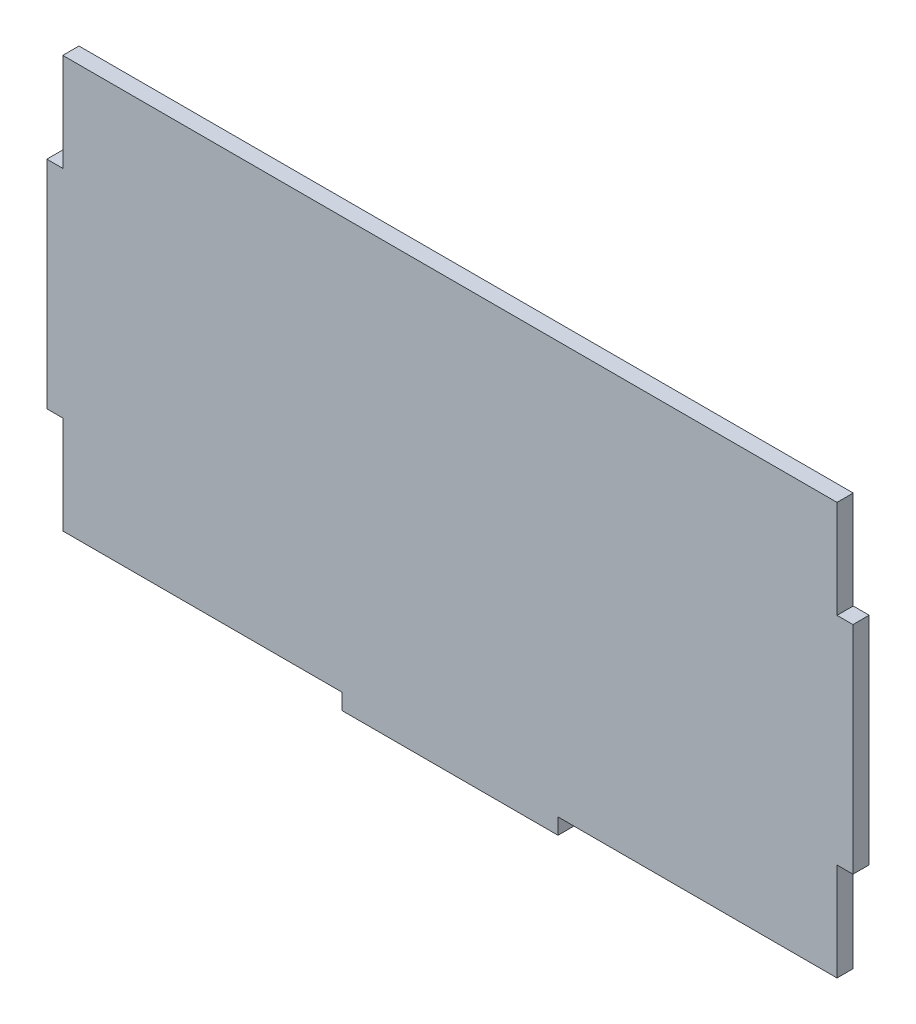
ISO-10303-21;
HEADER;
FILE_DESCRIPTION(('STEP AP214'),'2;1');
FILE_NAME('part.step','',(''),(''),'','','');
FILE_SCHEMA(('AUTOMOTIVE_DESIGN { 1 0 10303 214 1 1 1 1 }'));
ENDSEC;
DATA;
#1=APPLICATION_CONTEXT('core data for automotive mechanical design processes');
#2=APPLICATION_PROTOCOL_DEFINITION('international standard','automotive_design',2000,#1);
#3=PRODUCT_CONTEXT('',#1,'mechanical');
#4=PRODUCT('Part','Part','',(#3));
#5=PRODUCT_RELATED_PRODUCT_CATEGORY('part','',(#4));
#6=PRODUCT_DEFINITION_FORMATION('','',#4);
#7=PRODUCT_DEFINITION_CONTEXT('part definition',#1,'design');
#8=PRODUCT_DEFINITION('design','',#6,#7);
#9=PRODUCT_DEFINITION_SHAPE('','',#8);
#10=(LENGTH_UNIT() NAMED_UNIT(*) SI_UNIT(.MILLI.,.METRE.));
#11=(NAMED_UNIT(*) PLANE_ANGLE_UNIT() SI_UNIT($,.RADIAN.));
#12=(NAMED_UNIT(*) SI_UNIT($,.STERADIAN.) SOLID_ANGLE_UNIT());
#13=UNCERTAINTY_MEASURE_WITH_UNIT(LENGTH_MEASURE(1.E-05),#10,'distance_accuracy_value','');
#14=(GEOMETRIC_REPRESENTATION_CONTEXT(3) GLOBAL_UNCERTAINTY_ASSIGNED_CONTEXT((#13)) GLOBAL_UNIT_ASSIGNED_CONTEXT((#10,
#11,#12)) REPRESENTATION_CONTEXT('',''));
#15=CARTESIAN_POINT('',(0.,0.,0.));
#16=DIRECTION('',(0.,0.,1.));
#17=DIRECTION('',(1.,0.,0.));
#18=AXIS2_PLACEMENT_3D('',#15,#16,#17);
#19=CARTESIAN_POINT('',(71.6153,-38.1,1.4986));
#20=DIRECTION('',(-1.,0.,0.));
#21=DIRECTION('',(0.,0.,1.));
#22=AXIS2_PLACEMENT_3D('',#19,#20,#21);
#23=PLANE('',#22);
#24=DIRECTION('',(0.,0.,1.));
#25=VECTOR('',#24,1.);
#26=CARTESIAN_POINT('',(71.6153,20.,-1.4986));
#27=LINE('',#26,#25);
#28=CARTESIAN_POINT('',(71.6153,20.,-1.4986));
#29=VERTEX_POINT('',#28);
#30=CARTESIAN_POINT('',(71.6153,20.,1.4986));
#31=VERTEX_POINT('',#30);
#32=EDGE_CURVE('E217',#29,#31,#27,.T.);
#33=ORIENTED_EDGE('',*,*,#32,.F.);
#34=DIRECTION('',(0.,1.,0.));
#35=VECTOR('',#34,1.);
#36=CARTESIAN_POINT('',(71.6153,-38.1,-1.4986));
#37=LINE('',#36,#35);
#38=CARTESIAN_POINT('',(71.6153,38.1,-1.4986));
#39=VERTEX_POINT('',#38);
#40=EDGE_CURVE('E171',#29,#39,#37,.T.);
#41=ORIENTED_EDGE('',*,*,#40,.T.);
#42=DIRECTION('',(0.,0.,-1.));
#43=VECTOR('',#42,1.);
#44=CARTESIAN_POINT('',(71.6153,38.1,1.4986));
#45=LINE('',#44,#43);
#46=CARTESIAN_POINT('',(71.6153,38.1,1.4986));
#47=VERTEX_POINT('',#46);
#48=EDGE_CURVE('E11',#47,#39,#45,.T.);
#49=ORIENTED_EDGE('',*,*,#48,.F.);
#50=DIRECTION('',(0.,1.,0.));
#51=VECTOR('',#50,1.);
#52=CARTESIAN_POINT('',(71.6153,-38.1,1.4986));
#53=LINE('',#52,#51);
#54=EDGE_CURVE('E263',#31,#47,#53,.T.);
#55=ORIENTED_EDGE('',*,*,#54,.F.);
#56=EDGE_LOOP('',(#33,#41,#49,#55));
#57=FACE_BOUND('',#56,.T.);
#58=ADVANCED_FACE('F32',(#57),#23,.F.);
#59=CARTESIAN_POINT('',(-71.6153,-38.1,1.4986));
#60=DIRECTION('',(0.,1.,0.));
#61=DIRECTION('',(0.,0.,1.));
#62=AXIS2_PLACEMENT_3D('',#59,#60,#61);
#63=PLANE('',#62);
#64=DIRECTION('',(0.,0.,1.));
#65=VECTOR('',#64,1.);
#66=CARTESIAN_POINT('',(20.,-38.1,-1.4986));
#67=LINE('',#66,#65);
#68=CARTESIAN_POINT('',(20.,-38.1,-1.4986));
#69=VERTEX_POINT('',#68);
#70=CARTESIAN_POINT('',(20.,-38.1,1.4986));
#71=VERTEX_POINT('',#70);
#72=EDGE_CURVE('E224',#69,#71,#67,.T.);
#73=ORIENTED_EDGE('',*,*,#72,.F.);
#74=DIRECTION('',(1.,0.,0.));
#75=VECTOR('',#74,1.);
#76=CARTESIAN_POINT('',(-71.6153,-38.1,-1.4986));
#77=LINE('',#76,#75);
#78=CARTESIAN_POINT('',(71.6153,-38.1,-1.4986));
#79=VERTEX_POINT('',#78);
#80=EDGE_CURVE('E198',#69,#79,#77,.T.);
#81=ORIENTED_EDGE('',*,*,#80,.T.);
#82=DIRECTION('',(0.,0.,-1.));
#83=VECTOR('',#82,1.);
#84=CARTESIAN_POINT('',(71.6153,-38.1,1.4986));
#85=LINE('',#84,#83);
#86=CARTESIAN_POINT('',(71.6153,-38.1,1.4986));
#87=VERTEX_POINT('',#86);
#88=EDGE_CURVE('E169',#87,#79,#85,.T.);
#89=ORIENTED_EDGE('',*,*,#88,.F.);
#90=DIRECTION('',(1.,0.,0.));
#91=VECTOR('',#90,1.);
#92=CARTESIAN_POINT('',(-71.6153,-38.1,1.4986));
#93=LINE('',#92,#91);
#94=EDGE_CURVE('E206',#71,#87,#93,.T.);
#95=ORIENTED_EDGE('',*,*,#94,.F.);
#96=EDGE_LOOP('',(#73,#81,#89,#95));
#97=FACE_BOUND('',#96,.T.);
#98=ADVANCED_FACE('F260',(#97),#63,.F.);
#99=CARTESIAN_POINT('',(-71.6153,-38.1,1.4986));
#100=DIRECTION('',(1.,0.,0.));
#101=DIRECTION('',(0.,0.,-1.));
#102=AXIS2_PLACEMENT_3D('',#99,#100,#101);
#103=PLANE('',#102);
#104=DIRECTION('',(0.,0.,1.));
#105=VECTOR('',#104,1.);
#106=CARTESIAN_POINT('',(-71.6153,-20.,-1.4986));
#107=LINE('',#106,#105);
#108=CARTESIAN_POINT('',(-71.6153,-20.,-1.4986));
#109=VERTEX_POINT('',#108);
#110=CARTESIAN_POINT('',(-71.6153,-20.,1.4986));
#111=VERTEX_POINT('',#110);
#112=EDGE_CURVE('E175',#109,#111,#107,.T.);
#113=ORIENTED_EDGE('',*,*,#112,.F.);
#114=DIRECTION('',(0.,-1.,0.));
#115=VECTOR('',#114,1.);
#116=CARTESIAN_POINT('',(-71.6153,-38.1,-1.4986));
#117=LINE('',#116,#115);
#118=CARTESIAN_POINT('',(-71.6153,-38.1,-1.4986));
#119=VERTEX_POINT('',#118);
#120=EDGE_CURVE('E173',#109,#119,#117,.T.);
#121=ORIENTED_EDGE('',*,*,#120,.T.);
#122=DIRECTION('',(0.,0.,-1.));
#123=VECTOR('',#122,1.);
#124=CARTESIAN_POINT('',(-71.6153,-38.1,1.4986));
#125=LINE('',#124,#123);
#126=CARTESIAN_POINT('',(-71.6153,-38.1,1.4986));
#127=VERTEX_POINT('',#126);
#128=EDGE_CURVE('E202',#127,#119,#125,.T.);
#129=ORIENTED_EDGE('',*,*,#128,.F.);
#130=DIRECTION('',(0.,-1.,0.));
#131=VECTOR('',#130,1.);
#132=CARTESIAN_POINT('',(-71.6153,-38.1,1.4986));
#133=LINE('',#132,#131);
#134=EDGE_CURVE('E338',#111,#127,#133,.T.);
#135=ORIENTED_EDGE('',*,*,#134,.F.);
#136=EDGE_LOOP('',(#113,#121,#129,#135));
#137=FACE_BOUND('',#136,.T.);
#138=ADVANCED_FACE('F359',(#137),#103,.F.);
#139=CARTESIAN_POINT('',(71.6153,-20.,-1.4986));
#140=VERTEX_POINT('',#139);
#141=EDGE_CURVE('E161',#79,#140,#37,.T.);
#142=ORIENTED_EDGE('',*,*,#141,.T.);
#143=DIRECTION('',(0.,0.,1.));
#144=VECTOR('',#143,1.);
#145=CARTESIAN_POINT('',(71.6153,-20.,-1.4986));
#146=LINE('',#145,#144);
#147=CARTESIAN_POINT('',(71.6153,-20.,1.4986));
#148=VERTEX_POINT('',#147);
#149=EDGE_CURVE('E145',#140,#148,#146,.T.);
#150=ORIENTED_EDGE('',*,*,#149,.T.);
#151=EDGE_CURVE('E266',#87,#148,#53,.T.);
#152=ORIENTED_EDGE('',*,*,#151,.F.);
#153=ORIENTED_EDGE('',*,*,#88,.T.);
#154=EDGE_LOOP('',(#142,#150,#152,#153));
#155=FACE_BOUND('',#154,.T.);
#156=ADVANCED_FACE('F34',(#155),#23,.F.);
#157=CARTESIAN_POINT('',(-71.6153,38.1,1.4986));
#158=DIRECTION('',(0.,-1.,0.));
#159=DIRECTION('',(0.,0.,-1.));
#160=AXIS2_PLACEMENT_3D('',#157,#158,#159);
#161=PLANE('',#160);
#162=DIRECTION('',(-1.,0.,0.));
#163=VECTOR('',#162,1.);
#164=CARTESIAN_POINT('',(-71.6153,38.1,-1.4986));
#165=LINE('',#164,#163);
#166=CARTESIAN_POINT('',(-71.6153,38.1,-1.4986));
#167=VERTEX_POINT('',#166);
#168=EDGE_CURVE('E170',#39,#167,#165,.T.);
#169=ORIENTED_EDGE('',*,*,#168,.T.);
#170=DIRECTION('',(0.,0.,-1.));
#171=VECTOR('',#170,1.);
#172=CARTESIAN_POINT('',(-71.6153,38.1,1.4986));
#173=LINE('',#172,#171);
#174=CARTESIAN_POINT('',(-71.6153,38.1,1.4986));
#175=VERTEX_POINT('',#174);
#176=EDGE_CURVE('E41',#175,#167,#173,.T.);
#177=ORIENTED_EDGE('',*,*,#176,.F.);
#178=DIRECTION('',(-1.,0.,0.));
#179=VECTOR('',#178,1.);
#180=CARTESIAN_POINT('',(-71.6153,38.1,1.4986));
#181=LINE('',#180,#179);
#182=EDGE_CURVE('E337',#47,#175,#181,.T.);
#183=ORIENTED_EDGE('',*,*,#182,.F.);
#184=ORIENTED_EDGE('',*,*,#48,.T.);
#185=EDGE_LOOP('',(#169,#177,#183,#184));
#186=FACE_BOUND('',#185,.T.);
#187=ADVANCED_FACE('F380',(#186),#161,.F.);
#188=CARTESIAN_POINT('',(-71.6153,20.,-1.4986));
#189=VERTEX_POINT('',#188);
#190=EDGE_CURVE('E196',#167,#189,#117,.T.);
#191=ORIENTED_EDGE('',*,*,#190,.T.);
#192=DIRECTION('',(0.,0.,1.));
#193=VECTOR('',#192,1.);
#194=CARTESIAN_POINT('',(-71.6153,20.,-1.4986));
#195=LINE('',#194,#193);
#196=CARTESIAN_POINT('',(-71.6153,20.,1.4986));
#197=VERTEX_POINT('',#196);
#198=EDGE_CURVE('E280',#189,#197,#195,.T.);
#199=ORIENTED_EDGE('',*,*,#198,.T.);
#200=EDGE_CURVE('E210',#175,#197,#133,.T.);
#201=ORIENTED_EDGE('',*,*,#200,.F.);
#202=ORIENTED_EDGE('',*,*,#176,.T.);
#203=EDGE_LOOP('',(#191,#199,#201,#202));
#204=FACE_BOUND('',#203,.T.);
#205=ADVANCED_FACE('F349',(#204),#103,.F.);
#206=CARTESIAN_POINT('',(-20.,-38.1,-1.4986));
#207=VERTEX_POINT('',#206);
#208=EDGE_CURVE('E261',#119,#207,#77,.T.);
#209=ORIENTED_EDGE('',*,*,#208,.T.);
#210=DIRECTION('',(0.,0.,1.));
#211=VECTOR('',#210,1.);
#212=CARTESIAN_POINT('',(-20.,-38.1,-1.4986));
#213=LINE('',#212,#211);
#214=CARTESIAN_POINT('',(-20.,-38.1,1.4986));
#215=VERTEX_POINT('',#214);
#216=EDGE_CURVE('E220',#207,#215,#213,.T.);
#217=ORIENTED_EDGE('',*,*,#216,.T.);
#218=EDGE_CURVE('E204',#127,#215,#93,.T.);
#219=ORIENTED_EDGE('',*,*,#218,.F.);
#220=ORIENTED_EDGE('',*,*,#128,.T.);
#221=EDGE_LOOP('',(#209,#217,#219,#220));
#222=FACE_BOUND('',#221,.T.);
#223=ADVANCED_FACE('F377',(#222),#63,.F.);
#224=CARTESIAN_POINT('',(71.6153,38.1,1.4986));
#225=DIRECTION('',(0.,0.,-1.));
#226=DIRECTION('',(-1.,0.,0.));
#227=AXIS2_PLACEMENT_3D('',#224,#225,#226);
#228=PLANE('',#227);
#229=ORIENTED_EDGE('',*,*,#151,.T.);
#230=DIRECTION('',(1.,0.,0.));
#231=VECTOR('',#230,1.);
#232=CARTESIAN_POINT('',(71.6153,-20.,1.4986));
#233=LINE('',#232,#231);
#234=CARTESIAN_POINT('',(74.5617,-20.,1.4986));
#235=VERTEX_POINT('',#234);
#236=EDGE_CURVE('E49',#148,#235,#233,.T.);
#237=ORIENTED_EDGE('',*,*,#236,.T.);
#238=DIRECTION('',(0.,1.,0.));
#239=VECTOR('',#238,1.);
#240=CARTESIAN_POINT('',(74.5617,-20.,1.4986));
#241=LINE('',#240,#239);
#242=CARTESIAN_POINT('',(74.5617,20.,1.4986));
#243=VERTEX_POINT('',#242);
#244=EDGE_CURVE('E329',#235,#243,#241,.T.);
#245=ORIENTED_EDGE('',*,*,#244,.T.);
#246=DIRECTION('',(-1.,0.,0.));
#247=VECTOR('',#246,1.);
#248=CARTESIAN_POINT('',(71.6153,20.,1.4986));
#249=LINE('',#248,#247);
#250=EDGE_CURVE('E165',#243,#31,#249,.T.);
#251=ORIENTED_EDGE('',*,*,#250,.T.);
#252=ORIENTED_EDGE('',*,*,#54,.T.);
#253=ORIENTED_EDGE('',*,*,#182,.T.);
#254=ORIENTED_EDGE('',*,*,#200,.T.);
#255=DIRECTION('',(-1.,0.,0.));
#256=VECTOR('',#255,1.);
#257=CARTESIAN_POINT('',(-71.6153,20.,1.4986));
#258=LINE('',#257,#256);
#259=CARTESIAN_POINT('',(-74.5617,20.,1.4986));
#260=VERTEX_POINT('',#259);
#261=EDGE_CURVE('E223',#197,#260,#258,.T.);
#262=ORIENTED_EDGE('',*,*,#261,.T.);
#263=DIRECTION('',(0.,-1.,0.));
#264=VECTOR('',#263,1.);
#265=CARTESIAN_POINT('',(-74.5617,20.,1.4986));
#266=LINE('',#265,#264);
#267=CARTESIAN_POINT('',(-74.5617,-20.,1.4986));
#268=VERTEX_POINT('',#267);
#269=EDGE_CURVE('E275',#260,#268,#266,.T.);
#270=ORIENTED_EDGE('',*,*,#269,.T.);
#271=DIRECTION('',(1.,0.,0.));
#272=VECTOR('',#271,1.);
#273=CARTESIAN_POINT('',(-71.6153,-20.,1.4986));
#274=LINE('',#273,#272);
#275=EDGE_CURVE('E271',#268,#111,#274,.T.);
#276=ORIENTED_EDGE('',*,*,#275,.T.);
#277=ORIENTED_EDGE('',*,*,#134,.T.);
#278=ORIENTED_EDGE('',*,*,#218,.T.);
#279=DIRECTION('',(0.,-1.,0.));
#280=VECTOR('',#279,1.);
#281=CARTESIAN_POINT('',(-20.,-38.1,1.4986));
#282=LINE('',#281,#280);
#283=CARTESIAN_POINT('',(-20.,-41.0464,1.4986));
#284=VERTEX_POINT('',#283);
#285=EDGE_CURVE('E57',#215,#284,#282,.T.);
#286=ORIENTED_EDGE('',*,*,#285,.T.);
#287=DIRECTION('',(1.,0.,0.));
#288=VECTOR('',#287,1.);
#289=CARTESIAN_POINT('',(-20.,-41.0464,1.4986));
#290=LINE('',#289,#288);
#291=CARTESIAN_POINT('',(20.,-41.0464,1.4986));
#292=VERTEX_POINT('',#291);
#293=EDGE_CURVE('E216',#284,#292,#290,.T.);
#294=ORIENTED_EDGE('',*,*,#293,.T.);
#295=DIRECTION('',(0.,1.,0.));
#296=VECTOR('',#295,1.);
#297=CARTESIAN_POINT('',(20.,-38.1,1.4986));
#298=LINE('',#297,#296);
#299=EDGE_CURVE('E243',#292,#71,#298,.T.);
#300=ORIENTED_EDGE('',*,*,#299,.T.);
#301=ORIENTED_EDGE('',*,*,#94,.T.);
#302=EDGE_LOOP('',(#229,#237,#245,#251,#252,#253,#254,#262,#270,#276,#277,#278,#286,#294,#300,#301));
#303=FACE_BOUND('',#302,.T.);
#304=ADVANCED_FACE('F250',(#303),#228,.F.);
#305=CARTESIAN_POINT('',(71.6153,38.1,-1.4986));
#306=DIRECTION('',(0.,0.,-1.));
#307=DIRECTION('',(-1.,0.,0.));
#308=AXIS2_PLACEMENT_3D('',#305,#306,#307);
#309=PLANE('',#308);
#310=ORIENTED_EDGE('',*,*,#141,.F.);
#311=ORIENTED_EDGE('',*,*,#80,.F.);
#312=DIRECTION('',(0.,1.,0.));
#313=VECTOR('',#312,1.);
#314=CARTESIAN_POINT('',(20.,-38.1,-1.4986));
#315=LINE('',#314,#313);
#316=CARTESIAN_POINT('',(20.,-41.0464,-1.4986));
#317=VERTEX_POINT('',#316);
#318=EDGE_CURVE('E238',#317,#69,#315,.T.);
#319=ORIENTED_EDGE('',*,*,#318,.F.);
#320=DIRECTION('',(1.,0.,0.));
#321=VECTOR('',#320,1.);
#322=CARTESIAN_POINT('',(-20.,-41.0464,-1.4986));
#323=LINE('',#322,#321);
#324=CARTESIAN_POINT('',(-20.,-41.0464,-1.4986));
#325=VERTEX_POINT('',#324);
#326=EDGE_CURVE('E241',#325,#317,#323,.T.);
#327=ORIENTED_EDGE('',*,*,#326,.F.);
#328=DIRECTION('',(0.,-1.,0.));
#329=VECTOR('',#328,1.);
#330=CARTESIAN_POINT('',(-20.,-38.1,-1.4986));
#331=LINE('',#330,#329);
#332=EDGE_CURVE('E225',#207,#325,#331,.T.);
#333=ORIENTED_EDGE('',*,*,#332,.F.);
#334=ORIENTED_EDGE('',*,*,#208,.F.);
#335=ORIENTED_EDGE('',*,*,#120,.F.);
#336=DIRECTION('',(1.,0.,0.));
#337=VECTOR('',#336,1.);
#338=CARTESIAN_POINT('',(-71.6153,-20.,-1.4986));
#339=LINE('',#338,#337);
#340=CARTESIAN_POINT('',(-74.5617,-20.,-1.4986));
#341=VERTEX_POINT('',#340);
#342=EDGE_CURVE('E278',#341,#109,#339,.T.);
#343=ORIENTED_EDGE('',*,*,#342,.F.);
#344=DIRECTION('',(0.,-1.,0.));
#345=VECTOR('',#344,1.);
#346=CARTESIAN_POINT('',(-74.5617,20.,-1.4986));
#347=LINE('',#346,#345);
#348=CARTESIAN_POINT('',(-74.5617,20.,-1.4986));
#349=VERTEX_POINT('',#348);
#350=EDGE_CURVE('E281',#349,#341,#347,.T.);
#351=ORIENTED_EDGE('',*,*,#350,.F.);
#352=DIRECTION('',(-1.,0.,0.));
#353=VECTOR('',#352,1.);
#354=CARTESIAN_POINT('',(-71.6153,20.,-1.4986));
#355=LINE('',#354,#353);
#356=EDGE_CURVE('E274',#189,#349,#355,.T.);
#357=ORIENTED_EDGE('',*,*,#356,.F.);
#358=ORIENTED_EDGE('',*,*,#190,.F.);
#359=ORIENTED_EDGE('',*,*,#168,.F.);
#360=ORIENTED_EDGE('',*,*,#40,.F.);
#361=DIRECTION('',(-1.,0.,0.));
#362=VECTOR('',#361,1.);
#363=CARTESIAN_POINT('',(71.6153,20.,-1.4986));
#364=LINE('',#363,#362);
#365=CARTESIAN_POINT('',(74.5617,20.,-1.4986));
#366=VERTEX_POINT('',#365);
#367=EDGE_CURVE('E154',#366,#29,#364,.T.);
#368=ORIENTED_EDGE('',*,*,#367,.F.);
#369=DIRECTION('',(0.,1.,0.));
#370=VECTOR('',#369,1.);
#371=CARTESIAN_POINT('',(74.5617,-20.,-1.4986));
#372=LINE('',#371,#370);
#373=CARTESIAN_POINT('',(74.5617,-20.,-1.4986));
#374=VERTEX_POINT('',#373);
#375=EDGE_CURVE('E164',#374,#366,#372,.T.);
#376=ORIENTED_EDGE('',*,*,#375,.F.);
#377=DIRECTION('',(1.,0.,0.));
#378=VECTOR('',#377,1.);
#379=CARTESIAN_POINT('',(71.6153,-20.,-1.4986));
#380=LINE('',#379,#378);
#381=EDGE_CURVE('E148',#140,#374,#380,.T.);
#382=ORIENTED_EDGE('',*,*,#381,.F.);
#383=EDGE_LOOP('',(#310,#311,#319,#327,#333,#334,#335,#343,#351,#357,#358,#359,#360,#368,#376,#382));
#384=FACE_BOUND('',#383,.T.);
#385=ADVANCED_FACE('F159',(#384),#309,.T.);
#386=CARTESIAN_POINT('',(-71.6153,-20.,-1.4986));
#387=DIRECTION('',(0.,-1.,0.));
#388=DIRECTION('',(1.,0.,0.));
#389=AXIS2_PLACEMENT_3D('',#386,#387,#388);
#390=PLANE('',#389);
#391=ORIENTED_EDGE('',*,*,#275,.F.);
#392=DIRECTION('',(0.,0.,1.));
#393=VECTOR('',#392,1.);
#394=CARTESIAN_POINT('',(-74.5617,-20.,-1.4986));
#395=LINE('',#394,#393);
#396=EDGE_CURVE('E284',#341,#268,#395,.T.);
#397=ORIENTED_EDGE('',*,*,#396,.F.);
#398=ORIENTED_EDGE('',*,*,#342,.T.);
#399=ORIENTED_EDGE('',*,*,#112,.T.);
#400=EDGE_LOOP('',(#391,#397,#398,#399));
#401=FACE_BOUND('',#400,.T.);
#402=ADVANCED_FACE('F356',(#401),#390,.T.);
#403=CARTESIAN_POINT('',(-74.5617,20.,-1.4986));
#404=DIRECTION('',(-1.,0.,0.));
#405=DIRECTION('',(0.,0.,1.));
#406=AXIS2_PLACEMENT_3D('',#403,#404,#405);
#407=PLANE('',#406);
#408=ORIENTED_EDGE('',*,*,#269,.F.);
#409=DIRECTION('',(0.,0.,1.));
#410=VECTOR('',#409,1.);
#411=CARTESIAN_POINT('',(-74.5617,20.,-1.4986));
#412=LINE('',#411,#410);
#413=EDGE_CURVE('E292',#349,#260,#412,.T.);
#414=ORIENTED_EDGE('',*,*,#413,.F.);
#415=ORIENTED_EDGE('',*,*,#350,.T.);
#416=ORIENTED_EDGE('',*,*,#396,.T.);
#417=EDGE_LOOP('',(#408,#414,#415,#416));
#418=FACE_BOUND('',#417,.T.);
#419=ADVANCED_FACE('F362',(#418),#407,.T.);
#420=CARTESIAN_POINT('',(-71.6153,20.,-1.4986));
#421=DIRECTION('',(0.,1.,0.));
#422=DIRECTION('',(-1.,0.,0.));
#423=AXIS2_PLACEMENT_3D('',#420,#421,#422);
#424=PLANE('',#423);
#425=ORIENTED_EDGE('',*,*,#261,.F.);
#426=ORIENTED_EDGE('',*,*,#198,.F.);
#427=ORIENTED_EDGE('',*,*,#356,.T.);
#428=ORIENTED_EDGE('',*,*,#413,.T.);
#429=EDGE_LOOP('',(#425,#426,#427,#428));
#430=FACE_BOUND('',#429,.T.);
#431=ADVANCED_FACE('F351',(#430),#424,.T.);
#432=CARTESIAN_POINT('',(-20.,-38.1,-1.4986));
#433=DIRECTION('',(-1.,0.,0.));
#434=DIRECTION('',(0.,-1.,0.));
#435=AXIS2_PLACEMENT_3D('',#432,#433,#434);
#436=PLANE('',#435);
#437=ORIENTED_EDGE('',*,*,#285,.F.);
#438=ORIENTED_EDGE('',*,*,#216,.F.);
#439=ORIENTED_EDGE('',*,*,#332,.T.);
#440=DIRECTION('',(0.,0.,1.));
#441=VECTOR('',#440,1.);
#442=CARTESIAN_POINT('',(-20.,-41.0464,-1.4986));
#443=LINE('',#442,#441);
#444=EDGE_CURVE('E240',#325,#284,#443,.T.);
#445=ORIENTED_EDGE('',*,*,#444,.T.);
#446=EDGE_LOOP('',(#437,#438,#439,#445));
#447=FACE_BOUND('',#446,.T.);
#448=ADVANCED_FACE('F310',(#447),#436,.T.);
#449=CARTESIAN_POINT('',(20.,-38.1,-1.4986));
#450=DIRECTION('',(1.,0.,0.));
#451=DIRECTION('',(0.,1.,0.));
#452=AXIS2_PLACEMENT_3D('',#449,#450,#451);
#453=PLANE('',#452);
#454=ORIENTED_EDGE('',*,*,#299,.F.);
#455=DIRECTION('',(0.,0.,1.));
#456=VECTOR('',#455,1.);
#457=CARTESIAN_POINT('',(20.,-41.0464,-1.4986));
#458=LINE('',#457,#456);
#459=EDGE_CURVE('E233',#317,#292,#458,.T.);
#460=ORIENTED_EDGE('',*,*,#459,.F.);
#461=ORIENTED_EDGE('',*,*,#318,.T.);
#462=ORIENTED_EDGE('',*,*,#72,.T.);
#463=EDGE_LOOP('',(#454,#460,#461,#462));
#464=FACE_BOUND('',#463,.T.);
#465=ADVANCED_FACE('F257',(#464),#453,.T.);
#466=CARTESIAN_POINT('',(-20.,-41.0464,-1.4986));
#467=DIRECTION('',(0.,-1.,0.));
#468=DIRECTION('',(0.,0.,-1.));
#469=AXIS2_PLACEMENT_3D('',#466,#467,#468);
#470=PLANE('',#469);
#471=ORIENTED_EDGE('',*,*,#293,.F.);
#472=ORIENTED_EDGE('',*,*,#444,.F.);
#473=ORIENTED_EDGE('',*,*,#326,.T.);
#474=ORIENTED_EDGE('',*,*,#459,.T.);
#475=EDGE_LOOP('',(#471,#472,#473,#474));
#476=FACE_BOUND('',#475,.T.);
#477=ADVANCED_FACE('F252',(#476),#470,.T.);
#478=CARTESIAN_POINT('',(71.6153,20.,-1.4986));
#479=DIRECTION('',(0.,1.,0.));
#480=DIRECTION('',(0.,0.,1.));
#481=AXIS2_PLACEMENT_3D('',#478,#479,#480);
#482=PLANE('',#481);
#483=ORIENTED_EDGE('',*,*,#250,.F.);
#484=DIRECTION('',(0.,0.,1.));
#485=VECTOR('',#484,1.);
#486=CARTESIAN_POINT('',(74.5617,20.,-1.4986));
#487=LINE('',#486,#485);
#488=EDGE_CURVE('E325',#366,#243,#487,.T.);
#489=ORIENTED_EDGE('',*,*,#488,.F.);
#490=ORIENTED_EDGE('',*,*,#367,.T.);
#491=ORIENTED_EDGE('',*,*,#32,.T.);
#492=EDGE_LOOP('',(#483,#489,#490,#491));
#493=FACE_BOUND('',#492,.T.);
#494=ADVANCED_FACE('F442',(#493),#482,.T.);
#495=CARTESIAN_POINT('',(74.5617,-20.,-1.4986));
#496=DIRECTION('',(1.,0.,0.));
#497=DIRECTION('',(0.,0.,-1.));
#498=AXIS2_PLACEMENT_3D('',#495,#496,#497);
#499=PLANE('',#498);
#500=ORIENTED_EDGE('',*,*,#244,.F.);
#501=DIRECTION('',(0.,0.,1.));
#502=VECTOR('',#501,1.);
#503=CARTESIAN_POINT('',(74.5617,-20.,-1.4986));
#504=LINE('',#503,#502);
#505=EDGE_CURVE('E153',#374,#235,#504,.T.);
#506=ORIENTED_EDGE('',*,*,#505,.F.);
#507=ORIENTED_EDGE('',*,*,#375,.T.);
#508=ORIENTED_EDGE('',*,*,#488,.T.);
#509=EDGE_LOOP('',(#500,#506,#507,#508));
#510=FACE_BOUND('',#509,.T.);
#511=ADVANCED_FACE('F334',(#510),#499,.T.);
#512=CARTESIAN_POINT('',(71.6153,-20.,-1.4986));
#513=DIRECTION('',(0.,-1.,0.));
#514=DIRECTION('',(0.,0.,-1.));
#515=AXIS2_PLACEMENT_3D('',#512,#513,#514);
#516=PLANE('',#515);
#517=ORIENTED_EDGE('',*,*,#236,.F.);
#518=ORIENTED_EDGE('',*,*,#149,.F.);
#519=ORIENTED_EDGE('',*,*,#381,.T.);
#520=ORIENTED_EDGE('',*,*,#505,.T.);
#521=EDGE_LOOP('',(#517,#518,#519,#520));
#522=FACE_BOUND('',#521,.T.);
#523=ADVANCED_FACE('F147',(#522),#516,.T.);
#524=CLOSED_SHELL('',(#58,#98,#138,#156,#187,#205,#223,#304,#385,#402,#419,#431,#448,#465,#477,
#494,#511,#523));
#525=MANIFOLD_SOLID_BREP('B2',#524);
#526=ADVANCED_BREP_SHAPE_REPRESENTATION('',(#18,#525),#14);
#527=SHAPE_DEFINITION_REPRESENTATION(#9,#526);
ENDSEC;
END-ISO-10303-21;
